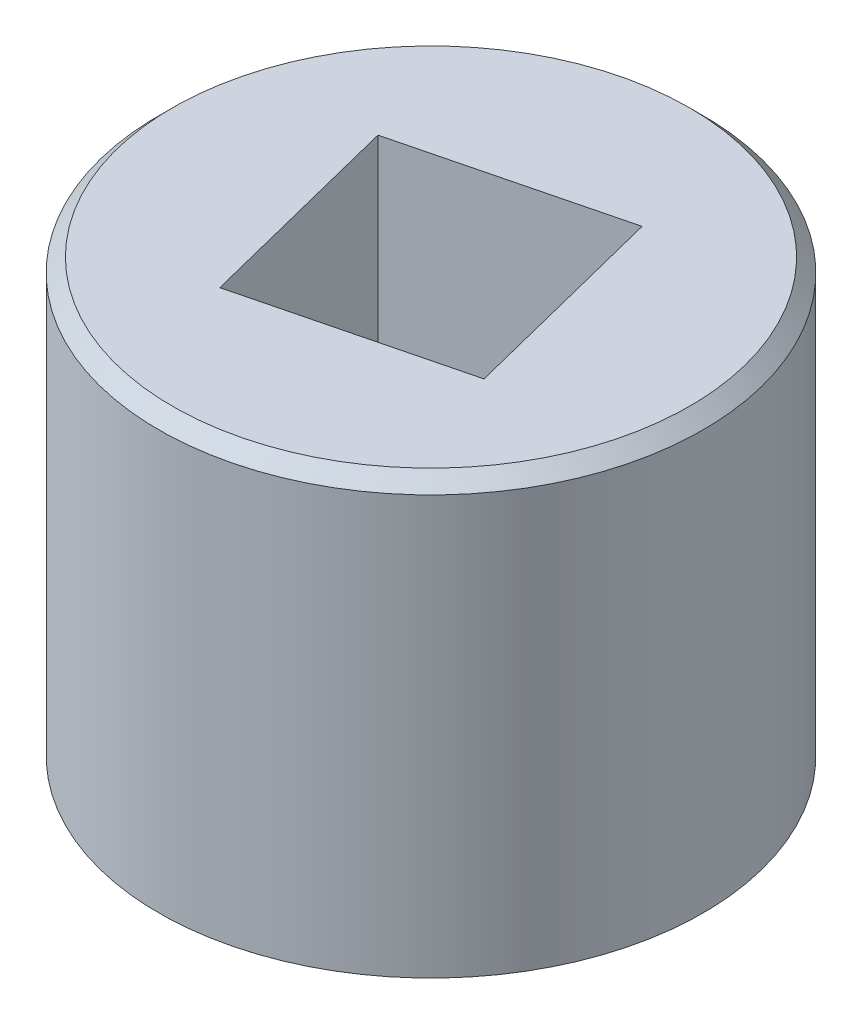
ISO-10303-21;
HEADER;
FILE_DESCRIPTION(('STEP AP214'),'2;1');
FILE_NAME('part.step','',(''),(''),'','','');
FILE_SCHEMA(('AUTOMOTIVE_DESIGN { 1 0 10303 214 1 1 1 1 }'));
ENDSEC;
DATA;
#1=APPLICATION_CONTEXT('core data for automotive mechanical design processes');
#2=APPLICATION_PROTOCOL_DEFINITION('international standard','automotive_design',2000,#1);
#3=PRODUCT_CONTEXT('',#1,'mechanical');
#4=PRODUCT('Part','Part','',(#3));
#5=PRODUCT_RELATED_PRODUCT_CATEGORY('part','',(#4));
#6=PRODUCT_DEFINITION_FORMATION('','',#4);
#7=PRODUCT_DEFINITION_CONTEXT('part definition',#1,'design');
#8=PRODUCT_DEFINITION('design','',#6,#7);
#9=PRODUCT_DEFINITION_SHAPE('','',#8);
#10=(LENGTH_UNIT() NAMED_UNIT(*) SI_UNIT(.MILLI.,.METRE.));
#11=(NAMED_UNIT(*) PLANE_ANGLE_UNIT() SI_UNIT($,.RADIAN.));
#12=(NAMED_UNIT(*) SI_UNIT($,.STERADIAN.) SOLID_ANGLE_UNIT());
#13=UNCERTAINTY_MEASURE_WITH_UNIT(LENGTH_MEASURE(1.E-05),#10,'distance_accuracy_value','');
#14=(GEOMETRIC_REPRESENTATION_CONTEXT(3) GLOBAL_UNCERTAINTY_ASSIGNED_CONTEXT((#13)) GLOBAL_UNIT_ASSIGNED_CONTEXT((#10,
#11,#12)) REPRESENTATION_CONTEXT('',''));
#15=CARTESIAN_POINT('',(0.,0.,0.));
#16=DIRECTION('',(0.,0.,1.));
#17=DIRECTION('',(1.,0.,0.));
#18=AXIS2_PLACEMENT_3D('',#15,#16,#17);
#19=CARTESIAN_POINT('',(-9.525,-6.225,0.));
#20=DIRECTION('',(0.,1.,0.));
#21=DIRECTION('',(0.243685399276188,0.,0.969854332453903));
#22=AXIS2_PLACEMENT_3D('',#19,#20,#21);
#23=PLANE('',#22);
#24=CARTESIAN_POINT('',(-9.525,-6.225,0.));
#25=DIRECTION('',(0.,-1.,0.));
#26=DIRECTION('',(0.969854332453903,0.,-0.243685399276188));
#27=AXIS2_PLACEMENT_3D('',#24,#25,#26);
#28=CIRCLE('',#27,4.);
#29=CARTESIAN_POINT('',(-5.64558267018439,-6.225,-0.974741597104752));
#30=VERTEX_POINT('',#29);
#31=EDGE_CURVE('E123',#30,#30,#28,.T.);
#32=ORIENTED_EDGE('',*,*,#31,.T.);
#33=EDGE_LOOP('',(#32));
#34=FACE_BOUND('',#33,.T.);
#35=ADVANCED_FACE('F21',(#34),#23,.F.);
#36=CARTESIAN_POINT('',(-7.58333642923186,-3.05,1.16187029308434));
#37=DIRECTION('',(0.969854332453903,0.,-0.243685399276188));
#38=DIRECTION('',(0.,-1.,0.));
#39=AXIS2_PLACEMENT_3D('',#36,#37,#38);
#40=PLANE('',#39);
#41=DIRECTION('',(0.243685399276188,0.,0.969854332453903));
#42=VECTOR('',#41,1.);
#43=CARTESIAN_POINT('',(-7.77828474865281,-5.875,0.385986827121221));
#44=LINE('',#43,#42);
#45=CARTESIAN_POINT('',(-8.36312970691566,-5.875,-1.94166357076814));
#46=VERTEX_POINT('',#45);
#47=CARTESIAN_POINT('',(-7.58333642923186,-5.875,1.16187029308434));
#48=VERTEX_POINT('',#47);
#49=EDGE_CURVE('E84',#46,#48,#44,.T.);
#50=ORIENTED_EDGE('',*,*,#49,.T.);
#51=DIRECTION('',(0.,-1.,0.));
#52=VECTOR('',#51,1.);
#53=CARTESIAN_POINT('',(-7.58333642923186,-3.05,1.16187029308434));
#54=LINE('',#53,#52);
#55=CARTESIAN_POINT('',(-7.58333642923186,0.125,1.16187029308434));
#56=VERTEX_POINT('',#55);
#57=EDGE_CURVE('E42',#56,#48,#54,.T.);
#58=ORIENTED_EDGE('',*,*,#57,.F.);
#59=DIRECTION('',(0.243685399276188,0.,0.969854332453903));
#60=VECTOR('',#59,1.);
#61=CARTESIAN_POINT('',(-7.77828474865281,0.125,0.385986827121221));
#62=LINE('',#61,#60);
#63=CARTESIAN_POINT('',(-8.36312970691566,0.125,-1.94166357076814));
#64=VERTEX_POINT('',#63);
#65=EDGE_CURVE('E97',#64,#56,#62,.T.);
#66=ORIENTED_EDGE('',*,*,#65,.F.);
#67=DIRECTION('',(0.,-1.,0.));
#68=VECTOR('',#67,1.);
#69=CARTESIAN_POINT('',(-8.36312970691566,-3.05,-1.94166357076814));
#70=LINE('',#69,#68);
#71=EDGE_CURVE('E12',#64,#46,#70,.T.);
#72=ORIENTED_EDGE('',*,*,#71,.T.);
#73=EDGE_LOOP('',(#50,#58,#66,#72));
#74=FACE_BOUND('',#73,.T.);
#75=ADVANCED_FACE('F147',(#74),#40,.F.);
#76=CARTESIAN_POINT('',(-8.36312970691566,-3.05,-1.94166357076814));
#77=DIRECTION('',(-0.243685399276188,0.,-0.969854332453903));
#78=DIRECTION('',(-0.969854332453903,0.,0.243685399276188));
#79=AXIS2_PLACEMENT_3D('',#76,#77,#78);
#80=PLANE('',#79);
#81=DIRECTION('',(0.969854332453903,0.,-0.243685399276188));
#82=VECTOR('',#81,1.);
#83=CARTESIAN_POINT('',(-9.13901317287878,-5.875,-1.74671525134719));
#84=LINE('',#83,#82);
#85=CARTESIAN_POINT('',(-11.4666635707681,-5.875,-1.16187029308434));
#86=VERTEX_POINT('',#85);
#87=EDGE_CURVE('E93',#86,#46,#84,.T.);
#88=ORIENTED_EDGE('',*,*,#87,.T.);
#89=ORIENTED_EDGE('',*,*,#71,.F.);
#90=DIRECTION('',(0.969854332453903,0.,-0.243685399276188));
#91=VECTOR('',#90,1.);
#92=CARTESIAN_POINT('',(-9.13901317287878,0.125,-1.74671525134719));
#93=LINE('',#92,#91);
#94=CARTESIAN_POINT('',(-11.4666635707681,0.125,-1.16187029308434));
#95=VERTEX_POINT('',#94);
#96=EDGE_CURVE('E103',#95,#64,#93,.T.);
#97=ORIENTED_EDGE('',*,*,#96,.F.);
#98=DIRECTION('',(0.,-1.,0.));
#99=VECTOR('',#98,1.);
#100=CARTESIAN_POINT('',(-11.4666635707681,-3.05,-1.16187029308434));
#101=LINE('',#100,#99);
#102=EDGE_CURVE('E29',#95,#86,#101,.T.);
#103=ORIENTED_EDGE('',*,*,#102,.T.);
#104=EDGE_LOOP('',(#88,#89,#97,#103));
#105=FACE_BOUND('',#104,.T.);
#106=ADVANCED_FACE('F143',(#105),#80,.F.);
#107=CARTESIAN_POINT('',(-11.4666635707681,-3.05,-1.16187029308434));
#108=DIRECTION('',(-0.969854332453903,0.,0.243685399276188));
#109=DIRECTION('',(0.243685399276188,0.,0.969854332453903));
#110=AXIS2_PLACEMENT_3D('',#107,#108,#109);
#111=PLANE('',#110);
#112=DIRECTION('',(-0.243685399276188,0.,-0.969854332453903));
#113=VECTOR('',#112,1.);
#114=CARTESIAN_POINT('',(-11.2717152513472,-5.875,-0.385986827121221));
#115=LINE('',#114,#113);
#116=CARTESIAN_POINT('',(-10.6868702930843,-5.875,1.94166357076814));
#117=VERTEX_POINT('',#116);
#118=EDGE_CURVE('E138',#117,#86,#115,.T.);
#119=ORIENTED_EDGE('',*,*,#118,.T.);
#120=ORIENTED_EDGE('',*,*,#102,.F.);
#121=DIRECTION('',(-0.243685399276188,0.,-0.969854332453903));
#122=VECTOR('',#121,1.);
#123=CARTESIAN_POINT('',(-11.2717152513472,0.125,-0.385986827121221));
#124=LINE('',#123,#122);
#125=CARTESIAN_POINT('',(-10.6868702930843,0.125,1.94166357076814));
#126=VERTEX_POINT('',#125);
#127=EDGE_CURVE('E87',#126,#95,#124,.T.);
#128=ORIENTED_EDGE('',*,*,#127,.F.);
#129=DIRECTION('',(0.,1.,0.));
#130=VECTOR('',#129,1.);
#131=CARTESIAN_POINT('',(-10.6868702930843,-3.05,1.94166357076814));
#132=LINE('',#131,#130);
#133=EDGE_CURVE('E53',#117,#126,#132,.T.);
#134=ORIENTED_EDGE('',*,*,#133,.F.);
#135=EDGE_LOOP('',(#119,#120,#128,#134));
#136=FACE_BOUND('',#135,.T.);
#137=ADVANCED_FACE('F88',(#136),#111,.F.);
#138=CARTESIAN_POINT('',(-10.6868702930843,-3.05,1.94166357076814));
#139=DIRECTION('',(0.243685399276188,0.,0.969854332453903));
#140=DIRECTION('',(0.,1.,0.));
#141=AXIS2_PLACEMENT_3D('',#138,#139,#140);
#142=PLANE('',#141);
#143=DIRECTION('',(-0.969854332453903,0.,0.243685399276188));
#144=VECTOR('',#143,1.);
#145=CARTESIAN_POINT('',(-9.91098682712122,-5.875,1.74671525134719));
#146=LINE('',#145,#144);
#147=EDGE_CURVE('E81',#48,#117,#146,.T.);
#148=ORIENTED_EDGE('',*,*,#147,.T.);
#149=ORIENTED_EDGE('',*,*,#133,.T.);
#150=DIRECTION('',(-0.969854332453903,0.,0.243685399276188));
#151=VECTOR('',#150,1.);
#152=CARTESIAN_POINT('',(-9.91098682712122,0.125,1.74671525134719));
#153=LINE('',#152,#151);
#154=EDGE_CURVE('E78',#56,#126,#153,.T.);
#155=ORIENTED_EDGE('',*,*,#154,.F.);
#156=ORIENTED_EDGE('',*,*,#57,.T.);
#157=EDGE_LOOP('',(#148,#149,#155,#156));
#158=FACE_BOUND('',#157,.T.);
#159=ADVANCED_FACE('F76',(#158),#142,.F.);
#160=CARTESIAN_POINT('',(-9.525,-5.875,0.));
#161=DIRECTION('',(0.,1.,0.));
#162=DIRECTION('',(0.243685399276188,0.,0.969854332453903));
#163=AXIS2_PLACEMENT_3D('',#160,#161,#162);
#164=PLANE('',#163);
#165=ORIENTED_EDGE('',*,*,#87,.F.);
#166=ORIENTED_EDGE('',*,*,#118,.F.);
#167=ORIENTED_EDGE('',*,*,#147,.F.);
#168=ORIENTED_EDGE('',*,*,#49,.F.);
#169=EDGE_LOOP('',(#165,#166,#167,#168));
#170=FACE_BOUND('',#169,.T.);
#171=ADVANCED_FACE('F159',(#170),#164,.T.);
#172=CARTESIAN_POINT('',(-9.525,0.125,0.));
#173=DIRECTION('',(0.,1.,0.));
#174=DIRECTION('',(0.243685399276188,0.,0.969854332453903));
#175=AXIS2_PLACEMENT_3D('',#172,#173,#174);
#176=PLANE('',#175);
#177=ORIENTED_EDGE('',*,*,#96,.T.);
#178=ORIENTED_EDGE('',*,*,#65,.T.);
#179=ORIENTED_EDGE('',*,*,#154,.T.);
#180=ORIENTED_EDGE('',*,*,#127,.T.);
#181=EDGE_LOOP('',(#177,#178,#179,#180));
#182=FACE_BOUND('',#181,.T.);
#183=CARTESIAN_POINT('',(-9.525,0.125,0.));
#184=DIRECTION('',(0.,-1.,0.));
#185=DIRECTION('',(0.969854332453903,0.,-0.243685399276188));
#186=AXIS2_PLACEMENT_3D('',#183,#184,#185);
#187=CIRCLE('',#186,3.8);
#188=CARTESIAN_POINT('',(-5.83955353667517,0.125,-0.926004517249514));
#189=VERTEX_POINT('',#188);
#190=EDGE_CURVE('E122',#189,#189,#187,.T.);
#191=ORIENTED_EDGE('',*,*,#190,.F.);
#192=EDGE_LOOP('',(#191));
#193=FACE_BOUND('',#192,.T.);
#194=ADVANCED_FACE('F94',(#182,#193),#176,.T.);
#195=CARTESIAN_POINT('',(-9.525,0.0249999999999998,0.));
#196=DIRECTION('',(0.,-1.,0.));
#197=DIRECTION('',(0.243685399276188,0.,0.969854332453903));
#198=AXIS2_PLACEMENT_3D('',#195,#196,#197);
#199=CONICAL_SURFACE('',#198,3.9,0.785398163397448);
#200=CARTESIAN_POINT('',(-9.525,-0.075,0.));
#201=DIRECTION('',(0.,1.,0.));
#202=DIRECTION('',(0.243685399276188,0.,0.969854332453903));
#203=AXIS2_PLACEMENT_3D('',#200,#201,#202);
#204=CIRCLE('',#203,4.);
#205=CARTESIAN_POINT('',(-8.55025840289525,-0.075,3.87941732981561));
#206=VERTEX_POINT('',#205);
#207=EDGE_CURVE('E116',#206,#206,#204,.T.);
#208=ORIENTED_EDGE('',*,*,#207,.T.);
#209=EDGE_LOOP('',(#208));
#210=FACE_BOUND('',#209,.T.);
#211=ORIENTED_EDGE('',*,*,#190,.T.);
#212=EDGE_LOOP('',(#211));
#213=FACE_BOUND('',#212,.T.);
#214=ADVANCED_FACE('F211',(#210,#213),#199,.T.);
#215=CARTESIAN_POINT('',(-9.525,-3.05,0.));
#216=DIRECTION('',(0.,1.,0.));
#217=DIRECTION('',(0.243685399276188,0.,0.969854332453903));
#218=AXIS2_PLACEMENT_3D('',#215,#216,#217);
#219=CYLINDRICAL_SURFACE('',#218,4.);
#220=ORIENTED_EDGE('',*,*,#207,.F.);
#221=EDGE_LOOP('',(#220));
#222=FACE_BOUND('',#221,.T.);
#223=ORIENTED_EDGE('',*,*,#31,.F.);
#224=EDGE_LOOP('',(#223));
#225=FACE_BOUND('',#224,.T.);
#226=ADVANCED_FACE('F206',(#222,#225),#219,.T.);
#227=CLOSED_SHELL('',(#35,#75,#106,#137,#159,#171,#194,#214,#226));
#228=MANIFOLD_SOLID_BREP('B1',#227);
#229=ADVANCED_BREP_SHAPE_REPRESENTATION('',(#18,#228),#14);
#230=SHAPE_DEFINITION_REPRESENTATION(#9,#229);
ENDSEC;
END-ISO-10303-21;
